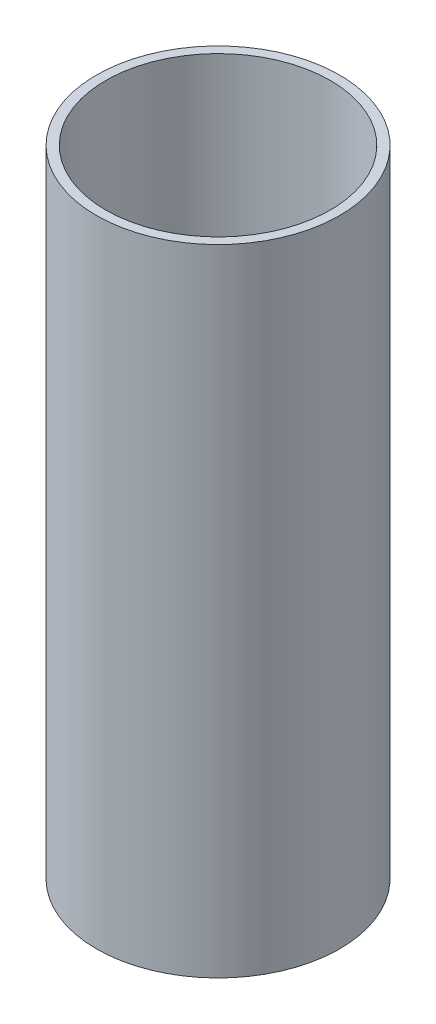
ISO-10303-21;
HEADER;
FILE_DESCRIPTION(('STEP AP214'),'2;1');
FILE_NAME('part.step','',(''),(''),'','','');
FILE_SCHEMA(('AUTOMOTIVE_DESIGN { 1 0 10303 214 1 1 1 1 }'));
ENDSEC;
DATA;
#1=APPLICATION_CONTEXT('core data for automotive mechanical design processes');
#2=APPLICATION_PROTOCOL_DEFINITION('international standard','automotive_design',2000,#1);
#3=PRODUCT_CONTEXT('',#1,'mechanical');
#4=PRODUCT('Part','Part','',(#3));
#5=PRODUCT_RELATED_PRODUCT_CATEGORY('part','',(#4));
#6=PRODUCT_DEFINITION_FORMATION('','',#4);
#7=PRODUCT_DEFINITION_CONTEXT('part definition',#1,'design');
#8=PRODUCT_DEFINITION('design','',#6,#7);
#9=PRODUCT_DEFINITION_SHAPE('','',#8);
#10=(LENGTH_UNIT() NAMED_UNIT(*) SI_UNIT(.MILLI.,.METRE.));
#11=(NAMED_UNIT(*) PLANE_ANGLE_UNIT() SI_UNIT($,.RADIAN.));
#12=(NAMED_UNIT(*) SI_UNIT($,.STERADIAN.) SOLID_ANGLE_UNIT());
#13=UNCERTAINTY_MEASURE_WITH_UNIT(LENGTH_MEASURE(1.E-05),#10,'distance_accuracy_value','');
#14=(GEOMETRIC_REPRESENTATION_CONTEXT(3) GLOBAL_UNCERTAINTY_ASSIGNED_CONTEXT((#13)) GLOBAL_UNIT_ASSIGNED_CONTEXT((#10,
#11,#12)) REPRESENTATION_CONTEXT('',''));
#15=CARTESIAN_POINT('',(0.,0.,0.));
#16=DIRECTION('',(0.,0.,1.));
#17=DIRECTION('',(1.,0.,0.));
#18=AXIS2_PLACEMENT_3D('',#15,#16,#17);
#19=CARTESIAN_POINT('',(0.,215.5,0.));
#20=DIRECTION('',(0.,1.,0.));
#21=DIRECTION('',(0.,0.,1.));
#22=AXIS2_PLACEMENT_3D('',#19,#20,#21);
#23=PLANE('',#22);
#24=CARTESIAN_POINT('',(0.,215.5,0.));
#25=DIRECTION('',(0.,1.,0.));
#26=DIRECTION('',(0.,0.,1.));
#27=AXIS2_PLACEMENT_3D('',#24,#25,#26);
#28=CIRCLE('',#27,82.55);
#29=CARTESIAN_POINT('',(0.,215.5,82.55));
#30=VERTEX_POINT('',#29);
#31=EDGE_CURVE('E10',#30,#30,#28,.T.);
#32=ORIENTED_EDGE('',*,*,#31,.T.);
#33=EDGE_LOOP('',(#32));
#34=FACE_BOUND('',#33,.T.);
#35=CARTESIAN_POINT('',(0.,215.5,0.));
#36=DIRECTION('',(0.,1.,0.));
#37=DIRECTION('',(0.,0.,1.));
#38=AXIS2_PLACEMENT_3D('',#35,#36,#37);
#39=CIRCLE('',#38,76.2);
#40=CARTESIAN_POINT('',(0.,215.5,76.2));
#41=VERTEX_POINT('',#40);
#42=EDGE_CURVE('E43',#41,#41,#39,.T.);
#43=ORIENTED_EDGE('',*,*,#42,.F.);
#44=EDGE_LOOP('',(#43));
#45=FACE_BOUND('',#44,.T.);
#46=ADVANCED_FACE('F32',(#34,#45),#23,.T.);
#47=CARTESIAN_POINT('',(0.,-215.5,0.));
#48=DIRECTION('',(0.,1.,0.));
#49=DIRECTION('',(0.,0.,1.));
#50=AXIS2_PLACEMENT_3D('',#47,#48,#49);
#51=PLANE('',#50);
#52=CARTESIAN_POINT('',(0.,-215.5,0.));
#53=DIRECTION('',(0.,1.,0.));
#54=DIRECTION('',(0.,0.,1.));
#55=AXIS2_PLACEMENT_3D('',#52,#53,#54);
#56=CIRCLE('',#55,82.55);
#57=CARTESIAN_POINT('',(0.,-215.5,82.55));
#58=VERTEX_POINT('',#57);
#59=EDGE_CURVE('E36',#58,#58,#56,.T.);
#60=ORIENTED_EDGE('',*,*,#59,.F.);
#61=EDGE_LOOP('',(#60));
#62=FACE_BOUND('',#61,.T.);
#63=CARTESIAN_POINT('',(0.,-215.5,0.));
#64=DIRECTION('',(0.,1.,0.));
#65=DIRECTION('',(0.,0.,1.));
#66=AXIS2_PLACEMENT_3D('',#63,#64,#65);
#67=CIRCLE('',#66,76.2);
#68=CARTESIAN_POINT('',(0.,-215.5,76.2));
#69=VERTEX_POINT('',#68);
#70=EDGE_CURVE('E45',#69,#69,#67,.T.);
#71=ORIENTED_EDGE('',*,*,#70,.T.);
#72=EDGE_LOOP('',(#71));
#73=FACE_BOUND('',#72,.T.);
#74=ADVANCED_FACE('F55',(#62,#73),#51,.F.);
#75=CARTESIAN_POINT('',(0.,215.5,0.));
#76=DIRECTION('',(0.,-1.,0.));
#77=DIRECTION('',(0.,0.,-1.));
#78=AXIS2_PLACEMENT_3D('',#75,#76,#77);
#79=CYLINDRICAL_SURFACE('',#78,82.55);
#80=ORIENTED_EDGE('',*,*,#31,.F.);
#81=EDGE_LOOP('',(#80));
#82=FACE_BOUND('',#81,.T.);
#83=ORIENTED_EDGE('',*,*,#59,.T.);
#84=EDGE_LOOP('',(#83));
#85=FACE_BOUND('',#84,.T.);
#86=ADVANCED_FACE('F34',(#82,#85),#79,.T.);
#87=CARTESIAN_POINT('',(0.,215.5,0.));
#88=DIRECTION('',(0.,-1.,0.));
#89=DIRECTION('',(0.,0.,-1.));
#90=AXIS2_PLACEMENT_3D('',#87,#88,#89);
#91=CYLINDRICAL_SURFACE('',#90,76.2);
#92=ORIENTED_EDGE('',*,*,#42,.T.);
#93=EDGE_LOOP('',(#92));
#94=FACE_BOUND('',#93,.T.);
#95=ORIENTED_EDGE('',*,*,#70,.F.);
#96=EDGE_LOOP('',(#95));
#97=FACE_BOUND('',#96,.T.);
#98=ADVANCED_FACE('F51',(#94,#97),#91,.F.);
#99=CLOSED_SHELL('',(#46,#74,#86,#98));
#100=MANIFOLD_SOLID_BREP('B2',#99);
#101=ADVANCED_BREP_SHAPE_REPRESENTATION('',(#18,#100),#14);
#102=SHAPE_DEFINITION_REPRESENTATION(#9,#101);
ENDSEC;
END-ISO-10303-21;
